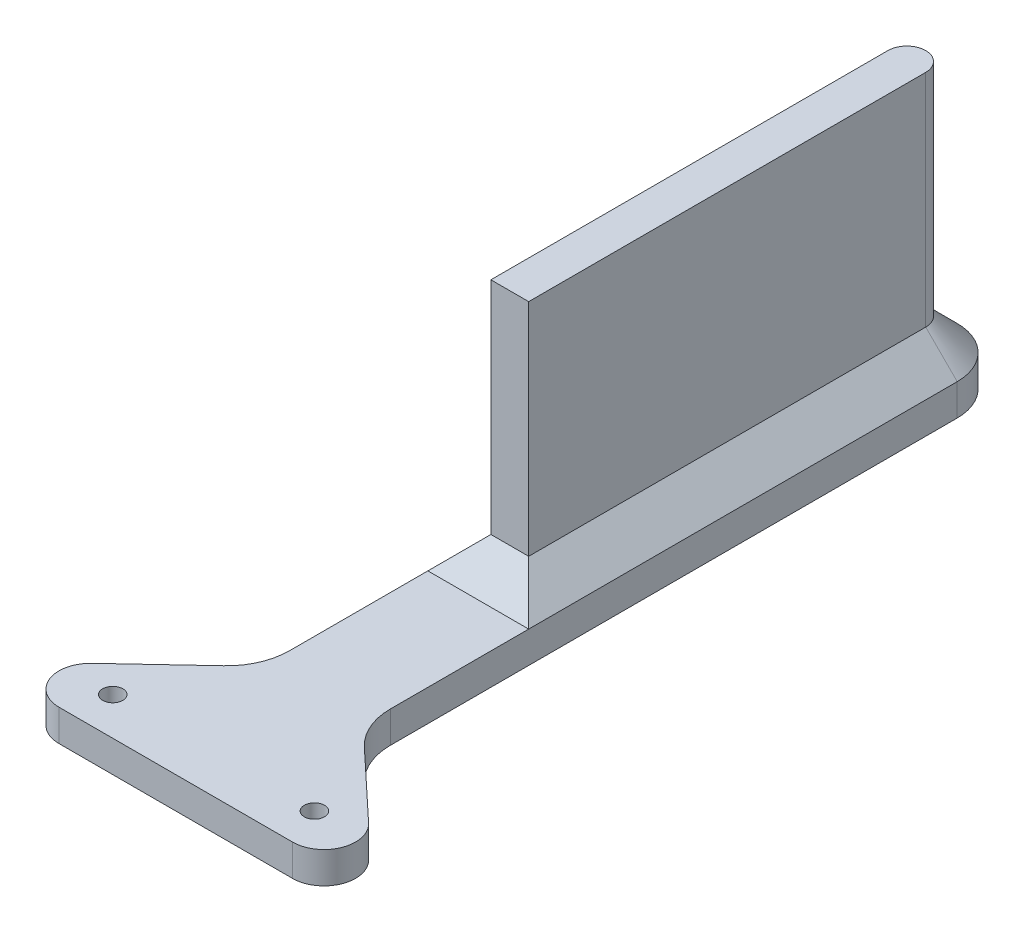
ISO-10303-21;
HEADER;
FILE_DESCRIPTION(('STEP AP214'),'2;1');
FILE_NAME('part.step','',(''),(''),'','','');
FILE_SCHEMA(('AUTOMOTIVE_DESIGN { 1 0 10303 214 1 1 1 1 }'));
ENDSEC;
DATA;
#1=APPLICATION_CONTEXT('core data for automotive mechanical design processes');
#2=APPLICATION_PROTOCOL_DEFINITION('international standard','automotive_design',2000,#1);
#3=PRODUCT_CONTEXT('',#1,'mechanical');
#4=PRODUCT('Part','Part','',(#3));
#5=PRODUCT_RELATED_PRODUCT_CATEGORY('part','',(#4));
#6=PRODUCT_DEFINITION_FORMATION('','',#4);
#7=PRODUCT_DEFINITION_CONTEXT('part definition',#1,'design');
#8=PRODUCT_DEFINITION('design','',#6,#7);
#9=PRODUCT_DEFINITION_SHAPE('','',#8);
#10=(LENGTH_UNIT() NAMED_UNIT(*) SI_UNIT(.MILLI.,.METRE.));
#11=(NAMED_UNIT(*) PLANE_ANGLE_UNIT() SI_UNIT($,.RADIAN.));
#12=(NAMED_UNIT(*) SI_UNIT($,.STERADIAN.) SOLID_ANGLE_UNIT());
#13=UNCERTAINTY_MEASURE_WITH_UNIT(LENGTH_MEASURE(1.E-05),#10,'distance_accuracy_value','');
#14=(GEOMETRIC_REPRESENTATION_CONTEXT(3) GLOBAL_UNCERTAINTY_ASSIGNED_CONTEXT((#13)) GLOBAL_UNIT_ASSIGNED_CONTEXT((#10,
#11,#12)) REPRESENTATION_CONTEXT('',''));
#15=CARTESIAN_POINT('',(0.,0.,0.));
#16=DIRECTION('',(0.,0.,1.));
#17=DIRECTION('',(1.,0.,0.));
#18=AXIS2_PLACEMENT_3D('',#15,#16,#17);
#19=CARTESIAN_POINT('',(18.,3.,-20.0567121994613));
#20=DIRECTION('',(0.,-1.,0.));
#21=DIRECTION('',(0.,0.,-1.));
#22=AXIS2_PLACEMENT_3D('',#19,#20,#21);
#23=PLANE('',#22);
#24=CARTESIAN_POINT('',(-16.,3.,0.));
#25=DIRECTION('',(0.,1.,0.));
#26=DIRECTION('',(0.,0.,1.));
#27=AXIS2_PLACEMENT_3D('',#24,#25,#26);
#28=CIRCLE('',#27,1.6);
#29=CARTESIAN_POINT('',(-16.,3.,1.6));
#30=VERTEX_POINT('',#29);
#31=EDGE_CURVE('E204',#30,#30,#28,.T.);
#32=ORIENTED_EDGE('',*,*,#31,.F.);
#33=EDGE_LOOP('',(#32));
#34=FACE_BOUND('',#33,.T.);
#35=CARTESIAN_POINT('',(16.,3.,0.));
#36=DIRECTION('',(0.,1.,0.));
#37=DIRECTION('',(0.,0.,1.));
#38=AXIS2_PLACEMENT_3D('',#35,#36,#37);
#39=CIRCLE('',#38,1.6);
#40=CARTESIAN_POINT('',(16.,3.,1.6));
#41=VERTEX_POINT('',#40);
#42=EDGE_CURVE('E203',#41,#41,#39,.T.);
#43=ORIENTED_EDGE('',*,*,#42,.F.);
#44=EDGE_LOOP('',(#43));
#45=FACE_BOUND('',#44,.T.);
#46=DIRECTION('',(0.,0.,-1.));
#47=VECTOR('',#46,1.);
#48=CARTESIAN_POINT('',(8.,3.,-95.));
#49=LINE('',#48,#47);
#50=CARTESIAN_POINT('',(8.00000000000001,3.,-20.0567121994613));
#51=VERTEX_POINT('',#50);
#52=CARTESIAN_POINT('',(8.,3.,-42.));
#53=VERTEX_POINT('',#52);
#54=EDGE_CURVE('E229',#51,#53,#49,.T.);
#55=ORIENTED_EDGE('',*,*,#54,.T.);
#56=DIRECTION('',(-1.,0.,0.));
#57=VECTOR('',#56,1.);
#58=CARTESIAN_POINT('',(-3.,3.,-42.));
#59=LINE('',#58,#57);
#60=CARTESIAN_POINT('',(-8.,3.,-42.));
#61=VERTEX_POINT('',#60);
#62=EDGE_CURVE('E270',#53,#61,#59,.T.);
#63=ORIENTED_EDGE('',*,*,#62,.T.);
#64=DIRECTION('',(0.,0.,1.));
#65=VECTOR('',#64,1.);
#66=CARTESIAN_POINT('',(-8.,3.,-110.));
#67=LINE('',#66,#65);
#68=CARTESIAN_POINT('',(-8.,3.,-20.0567121994614));
#69=VERTEX_POINT('',#68);
#70=EDGE_CURVE('E235',#61,#69,#67,.T.);
#71=ORIENTED_EDGE('',*,*,#70,.T.);
#72=CARTESIAN_POINT('',(-18.,3.,-20.0567121994613));
#73=DIRECTION('',(0.,-1.,0.));
#74=DIRECTION('',(0.,0.,1.));
#75=AXIS2_PLACEMENT_3D('',#72,#73,#74);
#76=CIRCLE('',#75,10.);
#77=CARTESIAN_POINT('',(-11.1605887111867,3.,-12.7613401580604));
#78=VERTEX_POINT('',#77);
#79=EDGE_CURVE('E239',#69,#78,#76,.T.);
#80=ORIENTED_EDGE('',*,*,#79,.T.);
#81=DIRECTION('',(-0.729537204140085,0.,0.68394112888133));
#82=VECTOR('',#81,1.);
#83=CARTESIAN_POINT('',(-11.1605887111867,3.,-12.7613401580604));
#84=LINE('',#83,#82);
#85=CARTESIAN_POINT('',(-21.948486457704,3.,-2.64768602070051));
#86=VERTEX_POINT('',#85);
#87=EDGE_CURVE('E241',#78,#86,#84,.T.);
#88=ORIENTED_EDGE('',*,*,#87,.T.);
#89=CARTESIAN_POINT('',(-18.5287808132974,3.,1.));
#90=DIRECTION('',(0.,1.,0.));
#91=DIRECTION('',(0.,0.,-1.));
#92=AXIS2_PLACEMENT_3D('',#89,#90,#91);
#93=CIRCLE('',#92,5.);
#94=CARTESIAN_POINT('',(-18.5287808132973,3.,6.));
#95=VERTEX_POINT('',#94);
#96=EDGE_CURVE('E243',#86,#95,#93,.T.);
#97=ORIENTED_EDGE('',*,*,#96,.T.);
#98=DIRECTION('',(1.,0.,0.));
#99=VECTOR('',#98,1.);
#100=CARTESIAN_POINT('',(-18.5287808132973,3.,6.));
#101=LINE('',#100,#99);
#102=CARTESIAN_POINT('',(18.5287808132973,3.,6.));
#103=VERTEX_POINT('',#102);
#104=EDGE_CURVE('E245',#95,#103,#101,.T.);
#105=ORIENTED_EDGE('',*,*,#104,.T.);
#106=CARTESIAN_POINT('',(18.5287808132974,3.,0.999999999999999));
#107=DIRECTION('',(0.,1.,0.));
#108=DIRECTION('',(0.,0.,1.));
#109=AXIS2_PLACEMENT_3D('',#106,#107,#108);
#110=CIRCLE('',#109,5.);
#111=CARTESIAN_POINT('',(21.948486457704,3.,-2.64768602070052));
#112=VERTEX_POINT('',#111);
#113=EDGE_CURVE('E247',#103,#112,#110,.T.);
#114=ORIENTED_EDGE('',*,*,#113,.T.);
#115=DIRECTION('',(-0.729537204140085,0.,-0.683941128881329));
#116=VECTOR('',#115,1.);
#117=CARTESIAN_POINT('',(21.948486457704,3.,-2.64768602070052));
#118=LINE('',#117,#116);
#119=CARTESIAN_POINT('',(11.1605887111867,3.,-12.7613401580604));
#120=VERTEX_POINT('',#119);
#121=EDGE_CURVE('E160',#112,#120,#118,.T.);
#122=ORIENTED_EDGE('',*,*,#121,.T.);
#123=CARTESIAN_POINT('',(18.,3.,-20.0567121994613));
#124=DIRECTION('',(0.,-1.,0.));
#125=DIRECTION('',(0.,0.,-1.));
#126=AXIS2_PLACEMENT_3D('',#123,#124,#125);
#127=CIRCLE('',#126,10.);
#128=EDGE_CURVE('E156',#120,#51,#127,.T.);
#129=ORIENTED_EDGE('',*,*,#128,.T.);
#130=EDGE_LOOP('',(#55,#63,#71,#80,#88,#97,#105,#114,#122,#129));
#131=FACE_BOUND('',#130,.T.);
#132=ADVANCED_FACE('F37',(#34,#45,#131),#23,.F.);
#133=CARTESIAN_POINT('',(18.,3.,-20.0567121994613));
#134=DIRECTION('',(0.,-1.,0.));
#135=DIRECTION('',(0.,0.,-1.));
#136=AXIS2_PLACEMENT_3D('',#133,#134,#135);
#137=CYLINDRICAL_SURFACE('',#136,10.);
#138=DIRECTION('',(0.,-1.,0.));
#139=VECTOR('',#138,1.);
#140=CARTESIAN_POINT('',(11.1605887111867,3.,-12.7613401580604));
#141=LINE('',#140,#139);
#142=CARTESIAN_POINT('',(11.1605887111867,-2.,-12.7613401580604));
#143=VERTEX_POINT('',#142);
#144=EDGE_CURVE('E149',#120,#143,#141,.T.);
#145=ORIENTED_EDGE('',*,*,#144,.T.);
#146=CARTESIAN_POINT('',(18.,-2.,-20.0567121994613));
#147=DIRECTION('',(0.,1.,0.));
#148=DIRECTION('',(0.,0.,-1.));
#149=AXIS2_PLACEMENT_3D('',#146,#147,#148);
#150=CIRCLE('',#149,10.);
#151=CARTESIAN_POINT('',(8.,-2.,-20.0567121994613));
#152=VERTEX_POINT('',#151);
#153=EDGE_CURVE('E154',#152,#143,#150,.T.);
#154=ORIENTED_EDGE('',*,*,#153,.F.);
#155=DIRECTION('',(0.,-1.,0.));
#156=VECTOR('',#155,1.);
#157=CARTESIAN_POINT('',(8.00000000000001,3.,-20.0567121994613));
#158=LINE('',#157,#156);
#159=EDGE_CURVE('E265',#51,#152,#158,.T.);
#160=ORIENTED_EDGE('',*,*,#159,.F.);
#161=ORIENTED_EDGE('',*,*,#128,.F.);
#162=EDGE_LOOP('',(#145,#154,#160,#161));
#163=FACE_BOUND('',#162,.T.);
#164=ADVANCED_FACE('F151',(#163),#137,.F.);
#165=CARTESIAN_POINT('',(8.,3.,-95.));
#166=DIRECTION('',(-1.,0.,0.));
#167=DIRECTION('',(0.,0.,1.));
#168=AXIS2_PLACEMENT_3D('',#165,#166,#167);
#169=PLANE('',#168);
#170=ORIENTED_EDGE('',*,*,#159,.T.);
#171=DIRECTION('',(0.,0.,1.));
#172=VECTOR('',#171,1.);
#173=CARTESIAN_POINT('',(8.,-2.,-110.));
#174=LINE('',#173,#172);
#175=CARTESIAN_POINT('',(8.,-2.,-110.));
#176=VERTEX_POINT('',#175);
#177=EDGE_CURVE('E176',#176,#152,#174,.T.);
#178=ORIENTED_EDGE('',*,*,#177,.F.);
#179=DIRECTION('',(0.,-1.,0.));
#180=VECTOR('',#179,1.);
#181=CARTESIAN_POINT('',(8.,3.,-110.));
#182=LINE('',#181,#180);
#183=CARTESIAN_POINT('',(8.,3.,-110.));
#184=VERTEX_POINT('',#183);
#185=EDGE_CURVE('E263',#184,#176,#182,.T.);
#186=ORIENTED_EDGE('',*,*,#185,.F.);
#187=EDGE_CURVE('E228',#53,#184,#49,.T.);
#188=ORIENTED_EDGE('',*,*,#187,.F.);
#189=ORIENTED_EDGE('',*,*,#54,.F.);
#190=EDGE_LOOP('',(#170,#178,#186,#188,#189));
#191=FACE_BOUND('',#190,.T.);
#192=ADVANCED_FACE('F336',(#191),#169,.F.);
#193=CARTESIAN_POINT('',(0.,3.,-110.));
#194=DIRECTION('',(0.,-1.,0.));
#195=DIRECTION('',(0.,0.,-1.));
#196=AXIS2_PLACEMENT_3D('',#193,#194,#195);
#197=CYLINDRICAL_SURFACE('',#196,8.);
#198=ORIENTED_EDGE('',*,*,#185,.T.);
#199=CARTESIAN_POINT('',(0.,-2.,-110.));
#200=DIRECTION('',(0.,-1.,0.));
#201=DIRECTION('',(0.,0.,-1.));
#202=AXIS2_PLACEMENT_3D('',#199,#200,#201);
#203=CIRCLE('',#202,8.);
#204=CARTESIAN_POINT('',(-8.,-2.,-110.));
#205=VERTEX_POINT('',#204);
#206=EDGE_CURVE('E200',#205,#176,#203,.T.);
#207=ORIENTED_EDGE('',*,*,#206,.F.);
#208=DIRECTION('',(0.,-1.,0.));
#209=VECTOR('',#208,1.);
#210=CARTESIAN_POINT('',(-8.,3.,-110.));
#211=LINE('',#210,#209);
#212=CARTESIAN_POINT('',(-8.,3.,-110.));
#213=VERTEX_POINT('',#212);
#214=EDGE_CURVE('E261',#213,#205,#211,.T.);
#215=ORIENTED_EDGE('',*,*,#214,.F.);
#216=CARTESIAN_POINT('',(0.,3.,-110.));
#217=DIRECTION('',(0.,1.,0.));
#218=DIRECTION('',(0.,0.,1.));
#219=AXIS2_PLACEMENT_3D('',#216,#217,#218);
#220=CIRCLE('',#219,8.);
#221=EDGE_CURVE('E232',#184,#213,#220,.T.);
#222=ORIENTED_EDGE('',*,*,#221,.F.);
#223=EDGE_LOOP('',(#198,#207,#215,#222));
#224=FACE_BOUND('',#223,.T.);
#225=ADVANCED_FACE('F292',(#224),#197,.T.);
#226=CARTESIAN_POINT('',(-8.,3.,-95.));
#227=DIRECTION('',(1.,0.,0.));
#228=DIRECTION('',(0.,0.,-1.));
#229=AXIS2_PLACEMENT_3D('',#226,#227,#228);
#230=PLANE('',#229);
#231=ORIENTED_EDGE('',*,*,#214,.T.);
#232=DIRECTION('',(0.,0.,-1.));
#233=VECTOR('',#232,1.);
#234=CARTESIAN_POINT('',(-8.,-2.,-20.0567121994614));
#235=LINE('',#234,#233);
#236=CARTESIAN_POINT('',(-8.,-2.,-20.0567121994614));
#237=VERTEX_POINT('',#236);
#238=EDGE_CURVE('E197',#237,#205,#235,.T.);
#239=ORIENTED_EDGE('',*,*,#238,.F.);
#240=DIRECTION('',(0.,-1.,0.));
#241=VECTOR('',#240,1.);
#242=CARTESIAN_POINT('',(-8.,3.,-20.0567121994614));
#243=LINE('',#242,#241);
#244=EDGE_CURVE('E259',#69,#237,#243,.T.);
#245=ORIENTED_EDGE('',*,*,#244,.F.);
#246=ORIENTED_EDGE('',*,*,#70,.F.);
#247=EDGE_CURVE('E236',#213,#61,#67,.T.);
#248=ORIENTED_EDGE('',*,*,#247,.F.);
#249=EDGE_LOOP('',(#231,#239,#245,#246,#248));
#250=FACE_BOUND('',#249,.T.);
#251=ADVANCED_FACE('F297',(#250),#230,.F.);
#252=CARTESIAN_POINT('',(-18.,3.,-20.0567121994613));
#253=DIRECTION('',(0.,-1.,0.));
#254=DIRECTION('',(0.,0.,-1.));
#255=AXIS2_PLACEMENT_3D('',#252,#253,#254);
#256=CYLINDRICAL_SURFACE('',#255,10.);
#257=ORIENTED_EDGE('',*,*,#244,.T.);
#258=CARTESIAN_POINT('',(-18.,-2.,-20.0567121994613));
#259=DIRECTION('',(0.,1.,0.));
#260=DIRECTION('',(0.,0.,-1.));
#261=AXIS2_PLACEMENT_3D('',#258,#259,#260);
#262=CIRCLE('',#261,10.);
#263=CARTESIAN_POINT('',(-11.1605887111867,-2.,-12.7613401580604));
#264=VERTEX_POINT('',#263);
#265=EDGE_CURVE('E194',#264,#237,#262,.T.);
#266=ORIENTED_EDGE('',*,*,#265,.F.);
#267=DIRECTION('',(0.,-1.,0.));
#268=VECTOR('',#267,1.);
#269=CARTESIAN_POINT('',(-11.1605887111867,3.,-12.7613401580604));
#270=LINE('',#269,#268);
#271=EDGE_CURVE('E257',#78,#264,#270,.T.);
#272=ORIENTED_EDGE('',*,*,#271,.F.);
#273=ORIENTED_EDGE('',*,*,#79,.F.);
#274=EDGE_LOOP('',(#257,#266,#272,#273));
#275=FACE_BOUND('',#274,.T.);
#276=ADVANCED_FACE('F358',(#275),#256,.F.);
#277=CARTESIAN_POINT('',(-11.1605887111867,3.,-12.7613401580604));
#278=DIRECTION('',(0.68394112888133,0.,0.729537204140085));
#279=DIRECTION('',(0.729537204140085,0.,-0.68394112888133));
#280=AXIS2_PLACEMENT_3D('',#277,#278,#279);
#281=PLANE('',#280);
#282=ORIENTED_EDGE('',*,*,#271,.T.);
#283=DIRECTION('',(0.729537204140085,0.,-0.68394112888133));
#284=VECTOR('',#283,1.);
#285=CARTESIAN_POINT('',(-21.948486457704,-2.,-2.64768602070051));
#286=LINE('',#285,#284);
#287=CARTESIAN_POINT('',(-21.948486457704,-2.,-2.64768602070051));
#288=VERTEX_POINT('',#287);
#289=EDGE_CURVE('E191',#288,#264,#286,.T.);
#290=ORIENTED_EDGE('',*,*,#289,.F.);
#291=DIRECTION('',(0.,-1.,0.));
#292=VECTOR('',#291,1.);
#293=CARTESIAN_POINT('',(-21.948486457704,3.,-2.64768602070051));
#294=LINE('',#293,#292);
#295=EDGE_CURVE('E255',#86,#288,#294,.T.);
#296=ORIENTED_EDGE('',*,*,#295,.F.);
#297=ORIENTED_EDGE('',*,*,#87,.F.);
#298=EDGE_LOOP('',(#282,#290,#296,#297));
#299=FACE_BOUND('',#298,.T.);
#300=ADVANCED_FACE('F354',(#299),#281,.F.);
#301=CARTESIAN_POINT('',(-18.5287808132974,3.,1.));
#302=DIRECTION('',(0.,-1.,0.));
#303=DIRECTION('',(0.,0.,-1.));
#304=AXIS2_PLACEMENT_3D('',#301,#302,#303);
#305=CYLINDRICAL_SURFACE('',#304,5.);
#306=ORIENTED_EDGE('',*,*,#295,.T.);
#307=CARTESIAN_POINT('',(-18.5287808132974,-2.,1.));
#308=DIRECTION('',(0.,-1.,0.));
#309=DIRECTION('',(0.,0.,-1.));
#310=AXIS2_PLACEMENT_3D('',#307,#308,#309);
#311=CIRCLE('',#310,5.);
#312=CARTESIAN_POINT('',(-18.5287808132973,-2.,6.));
#313=VERTEX_POINT('',#312);
#314=EDGE_CURVE('E188',#313,#288,#311,.T.);
#315=ORIENTED_EDGE('',*,*,#314,.F.);
#316=DIRECTION('',(0.,-1.,0.));
#317=VECTOR('',#316,1.);
#318=CARTESIAN_POINT('',(-18.5287808132973,3.,6.));
#319=LINE('',#318,#317);
#320=EDGE_CURVE('E253',#95,#313,#319,.T.);
#321=ORIENTED_EDGE('',*,*,#320,.F.);
#322=ORIENTED_EDGE('',*,*,#96,.F.);
#323=EDGE_LOOP('',(#306,#315,#321,#322));
#324=FACE_BOUND('',#323,.T.);
#325=ADVANCED_FACE('F350',(#324),#305,.T.);
#326=CARTESIAN_POINT('',(-18.5287808132973,3.,6.));
#327=DIRECTION('',(0.,0.,-1.));
#328=DIRECTION('',(-1.,0.,0.));
#329=AXIS2_PLACEMENT_3D('',#326,#327,#328);
#330=PLANE('',#329);
#331=ORIENTED_EDGE('',*,*,#320,.T.);
#332=DIRECTION('',(-1.,0.,0.));
#333=VECTOR('',#332,1.);
#334=CARTESIAN_POINT('',(18.5287808132973,-2.,6.));
#335=LINE('',#334,#333);
#336=CARTESIAN_POINT('',(18.5287808132973,-2.,6.));
#337=VERTEX_POINT('',#336);
#338=EDGE_CURVE('E185',#337,#313,#335,.T.);
#339=ORIENTED_EDGE('',*,*,#338,.F.);
#340=DIRECTION('',(0.,-1.,0.));
#341=VECTOR('',#340,1.);
#342=CARTESIAN_POINT('',(18.5287808132973,3.,6.));
#343=LINE('',#342,#341);
#344=EDGE_CURVE('E251',#103,#337,#343,.T.);
#345=ORIENTED_EDGE('',*,*,#344,.F.);
#346=ORIENTED_EDGE('',*,*,#104,.F.);
#347=EDGE_LOOP('',(#331,#339,#345,#346));
#348=FACE_BOUND('',#347,.T.);
#349=ADVANCED_FACE('F346',(#348),#330,.F.);
#350=CARTESIAN_POINT('',(18.5287808132974,3.,0.999999999999999));
#351=DIRECTION('',(0.,-1.,0.));
#352=DIRECTION('',(0.,0.,-1.));
#353=AXIS2_PLACEMENT_3D('',#350,#351,#352);
#354=CYLINDRICAL_SURFACE('',#353,5.);
#355=ORIENTED_EDGE('',*,*,#344,.T.);
#356=CARTESIAN_POINT('',(18.5287808132974,-2.,0.999999999999999));
#357=DIRECTION('',(0.,-1.,0.));
#358=DIRECTION('',(0.,0.,-1.));
#359=AXIS2_PLACEMENT_3D('',#356,#357,#358);
#360=CIRCLE('',#359,5.);
#361=CARTESIAN_POINT('',(21.948486457704,-2.,-2.64768602070052));
#362=VERTEX_POINT('',#361);
#363=EDGE_CURVE('E169',#362,#337,#360,.T.);
#364=ORIENTED_EDGE('',*,*,#363,.F.);
#365=DIRECTION('',(0.,-1.,0.));
#366=VECTOR('',#365,1.);
#367=CARTESIAN_POINT('',(21.948486457704,3.,-2.64768602070052));
#368=LINE('',#367,#366);
#369=EDGE_CURVE('E159',#112,#362,#368,.T.);
#370=ORIENTED_EDGE('',*,*,#369,.F.);
#371=ORIENTED_EDGE('',*,*,#113,.F.);
#372=EDGE_LOOP('',(#355,#364,#370,#371));
#373=FACE_BOUND('',#372,.T.);
#374=ADVANCED_FACE('F343',(#373),#354,.T.);
#375=CARTESIAN_POINT('',(21.948486457704,3.,-2.64768602070052));
#376=DIRECTION('',(-0.683941128881329,0.,0.729537204140085));
#377=DIRECTION('',(0.729537204140085,0.,0.683941128881329));
#378=AXIS2_PLACEMENT_3D('',#375,#376,#377);
#379=PLANE('',#378);
#380=ORIENTED_EDGE('',*,*,#369,.T.);
#381=DIRECTION('',(0.729537204140085,0.,0.68394112888133));
#382=VECTOR('',#381,1.);
#383=CARTESIAN_POINT('',(11.1605887111867,-2.,-12.7613401580604));
#384=LINE('',#383,#382);
#385=EDGE_CURVE('E163',#143,#362,#384,.T.);
#386=ORIENTED_EDGE('',*,*,#385,.F.);
#387=ORIENTED_EDGE('',*,*,#144,.F.);
#388=ORIENTED_EDGE('',*,*,#121,.F.);
#389=EDGE_LOOP('',(#380,#386,#387,#388));
#390=FACE_BOUND('',#389,.T.);
#391=ADVANCED_FACE('F164',(#390),#379,.F.);
#392=CARTESIAN_POINT('',(3.,43.,-110.));
#393=DIRECTION('',(-1.,0.,0.));
#394=DIRECTION('',(0.,0.,1.));
#395=AXIS2_PLACEMENT_3D('',#392,#393,#394);
#396=PLANE('',#395);
#397=DIRECTION('',(0.,-1.,0.));
#398=VECTOR('',#397,1.);
#399=CARTESIAN_POINT('',(3.,43.,-47.));
#400=LINE('',#399,#398);
#401=CARTESIAN_POINT('',(3.,43.,-47.));
#402=VERTEX_POINT('',#401);
#403=CARTESIAN_POINT('',(3.,8.00000000000004,-47.));
#404=VERTEX_POINT('',#403);
#405=EDGE_CURVE('E218',#402,#404,#400,.T.);
#406=ORIENTED_EDGE('',*,*,#405,.T.);
#407=DIRECTION('',(0.,0.,-1.));
#408=VECTOR('',#407,1.);
#409=CARTESIAN_POINT('',(3.,8.00000000000004,-110.));
#410=LINE('',#409,#408);
#411=CARTESIAN_POINT('',(3.,8.00000000000004,-110.));
#412=VERTEX_POINT('',#411);
#413=EDGE_CURVE('E62',#404,#412,#410,.T.);
#414=ORIENTED_EDGE('',*,*,#413,.T.);
#415=DIRECTION('',(0.,-1.,0.));
#416=VECTOR('',#415,1.);
#417=CARTESIAN_POINT('',(3.,43.,-110.));
#418=LINE('',#417,#416);
#419=CARTESIAN_POINT('',(3.,43.,-110.));
#420=VERTEX_POINT('',#419);
#421=EDGE_CURVE('E225',#420,#412,#418,.T.);
#422=ORIENTED_EDGE('',*,*,#421,.F.);
#423=DIRECTION('',(0.,0.,-1.));
#424=VECTOR('',#423,1.);
#425=CARTESIAN_POINT('',(3.,43.,-47.));
#426=LINE('',#425,#424);
#427=EDGE_CURVE('E210',#402,#420,#426,.T.);
#428=ORIENTED_EDGE('',*,*,#427,.F.);
#429=EDGE_LOOP('',(#406,#414,#422,#428));
#430=FACE_BOUND('',#429,.T.);
#431=ADVANCED_FACE('F314',(#430),#396,.F.);
#432=CARTESIAN_POINT('',(0.,43.,-110.));
#433=DIRECTION('',(0.,-1.,0.));
#434=DIRECTION('',(0.,0.,-1.));
#435=AXIS2_PLACEMENT_3D('',#432,#433,#434);
#436=CYLINDRICAL_SURFACE('',#435,3.);
#437=ORIENTED_EDGE('',*,*,#421,.T.);
#438=CARTESIAN_POINT('',(0.,8.00000000000004,-110.));
#439=DIRECTION('',(0.,-1.,0.));
#440=DIRECTION('',(0.,0.,-1.));
#441=AXIS2_PLACEMENT_3D('',#438,#439,#440);
#442=CIRCLE('',#441,3.);
#443=CARTESIAN_POINT('',(-3.,8.00000000000004,-110.));
#444=VERTEX_POINT('',#443);
#445=EDGE_CURVE('E47',#412,#444,#442,.F.);
#446=ORIENTED_EDGE('',*,*,#445,.T.);
#447=DIRECTION('',(0.,-1.,0.));
#448=VECTOR('',#447,1.);
#449=CARTESIAN_POINT('',(-3.,43.,-110.));
#450=LINE('',#449,#448);
#451=CARTESIAN_POINT('',(-3.,43.,-110.));
#452=VERTEX_POINT('',#451);
#453=EDGE_CURVE('E223',#452,#444,#450,.T.);
#454=ORIENTED_EDGE('',*,*,#453,.F.);
#455=CARTESIAN_POINT('',(0.,43.,-110.));
#456=DIRECTION('',(0.,1.,0.));
#457=DIRECTION('',(0.,0.,1.));
#458=AXIS2_PLACEMENT_3D('',#455,#456,#457);
#459=CIRCLE('',#458,3.);
#460=EDGE_CURVE('E212',#420,#452,#459,.T.);
#461=ORIENTED_EDGE('',*,*,#460,.F.);
#462=EDGE_LOOP('',(#437,#446,#454,#461));
#463=FACE_BOUND('',#462,.T.);
#464=ADVANCED_FACE('F321',(#463),#436,.T.);
#465=CARTESIAN_POINT('',(-3.,43.,-95.));
#466=DIRECTION('',(1.,0.,0.));
#467=DIRECTION('',(0.,0.,-1.));
#468=AXIS2_PLACEMENT_3D('',#465,#466,#467);
#469=PLANE('',#468);
#470=ORIENTED_EDGE('',*,*,#453,.T.);
#471=DIRECTION('',(0.,0.,1.));
#472=VECTOR('',#471,1.);
#473=CARTESIAN_POINT('',(-3.,8.00000000000004,-47.));
#474=LINE('',#473,#472);
#475=CARTESIAN_POINT('',(-3.,8.00000000000004,-47.));
#476=VERTEX_POINT('',#475);
#477=EDGE_CURVE('E11',#444,#476,#474,.T.);
#478=ORIENTED_EDGE('',*,*,#477,.T.);
#479=DIRECTION('',(0.,-1.,0.));
#480=VECTOR('',#479,1.);
#481=CARTESIAN_POINT('',(-3.,43.,-47.));
#482=LINE('',#481,#480);
#483=CARTESIAN_POINT('',(-3.,43.,-47.));
#484=VERTEX_POINT('',#483);
#485=EDGE_CURVE('E220',#484,#476,#482,.T.);
#486=ORIENTED_EDGE('',*,*,#485,.F.);
#487=DIRECTION('',(0.,0.,1.));
#488=VECTOR('',#487,1.);
#489=CARTESIAN_POINT('',(-3.,43.,-95.));
#490=LINE('',#489,#488);
#491=EDGE_CURVE('E214',#452,#484,#490,.T.);
#492=ORIENTED_EDGE('',*,*,#491,.F.);
#493=EDGE_LOOP('',(#470,#478,#486,#492));
#494=FACE_BOUND('',#493,.T.);
#495=ADVANCED_FACE('F320',(#494),#469,.F.);
#496=CARTESIAN_POINT('',(3.,43.,-47.));
#497=DIRECTION('',(0.,0.,-1.));
#498=DIRECTION('',(-1.,0.,0.));
#499=AXIS2_PLACEMENT_3D('',#496,#497,#498);
#500=PLANE('',#499);
#501=ORIENTED_EDGE('',*,*,#485,.T.);
#502=DIRECTION('',(1.,0.,0.));
#503=VECTOR('',#502,1.);
#504=CARTESIAN_POINT('',(3.,8.00000000000004,-47.));
#505=LINE('',#504,#503);
#506=EDGE_CURVE('E267',#476,#404,#505,.T.);
#507=ORIENTED_EDGE('',*,*,#506,.T.);
#508=ORIENTED_EDGE('',*,*,#405,.F.);
#509=DIRECTION('',(1.,0.,0.));
#510=VECTOR('',#509,1.);
#511=CARTESIAN_POINT('',(3.,43.,-47.));
#512=LINE('',#511,#510);
#513=EDGE_CURVE('E216',#484,#402,#512,.T.);
#514=ORIENTED_EDGE('',*,*,#513,.F.);
#515=EDGE_LOOP('',(#501,#507,#508,#514));
#516=FACE_BOUND('',#515,.T.);
#517=ADVANCED_FACE('F310',(#516),#500,.F.);
#518=CARTESIAN_POINT('',(0.,43.,-110.));
#519=DIRECTION('',(0.,1.,0.));
#520=DIRECTION('',(0.,0.,1.));
#521=AXIS2_PLACEMENT_3D('',#518,#519,#520);
#522=PLANE('',#521);
#523=ORIENTED_EDGE('',*,*,#427,.T.);
#524=ORIENTED_EDGE('',*,*,#460,.T.);
#525=ORIENTED_EDGE('',*,*,#491,.T.);
#526=ORIENTED_EDGE('',*,*,#513,.T.);
#527=EDGE_LOOP('',(#523,#524,#525,#526));
#528=FACE_BOUND('',#527,.T.);
#529=ADVANCED_FACE('F317',(#528),#522,.T.);
#530=CARTESIAN_POINT('',(0.,8.00000000000004,-110.));
#531=DIRECTION('',(0.,-1.,0.));
#532=DIRECTION('',(0.,0.,-1.));
#533=AXIS2_PLACEMENT_3D('',#530,#531,#532);
#534=CONICAL_SURFACE('',#533,3.,0.785398163397443);
#535=DIRECTION('',(-0.707106781186544,0.707106781186551,0.));
#536=VECTOR('',#535,1.);
#537=CARTESIAN_POINT('',(7.99999999999999,3.,-110.));
#538=LINE('',#537,#536);
#539=EDGE_CURVE('E277',#184,#412,#538,.T.);
#540=ORIENTED_EDGE('',*,*,#539,.F.);
#541=ORIENTED_EDGE('',*,*,#221,.T.);
#542=DIRECTION('',(-0.707106781186544,-0.707106781186551,0.));
#543=VECTOR('',#542,1.);
#544=CARTESIAN_POINT('',(-3.,8.00000000000004,-110.));
#545=LINE('',#544,#543);
#546=EDGE_CURVE('E42',#444,#213,#545,.T.);
#547=ORIENTED_EDGE('',*,*,#546,.F.);
#548=ORIENTED_EDGE('',*,*,#445,.F.);
#549=EDGE_LOOP('',(#540,#541,#547,#548));
#550=FACE_BOUND('',#549,.T.);
#551=ADVANCED_FACE('F40',(#550),#534,.T.);
#552=CARTESIAN_POINT('',(-3.,8.00000000000004,-95.));
#553=DIRECTION('',(-0.707106781186551,0.707106781186544,0.));
#554=DIRECTION('',(0.,0.,-1.));
#555=AXIS2_PLACEMENT_3D('',#552,#553,#554);
#556=PLANE('',#555);
#557=ORIENTED_EDGE('',*,*,#546,.T.);
#558=ORIENTED_EDGE('',*,*,#247,.T.);
#559=DIRECTION('',(0.577350269189624,0.57735026918963,-0.577350269189624));
#560=VECTOR('',#559,1.);
#561=CARTESIAN_POINT('',(12.9999999999999,24.0000000000001,-62.9999999999999));
#562=LINE('',#561,#560);
#563=EDGE_CURVE('E276',#476,#61,#562,.F.);
#564=ORIENTED_EDGE('',*,*,#563,.F.);
#565=ORIENTED_EDGE('',*,*,#477,.F.);
#566=EDGE_LOOP('',(#557,#558,#564,#565));
#567=FACE_BOUND('',#566,.T.);
#568=ADVANCED_FACE('F286',(#567),#556,.T.);
#569=CARTESIAN_POINT('',(3.,8.00000000000004,-110.));
#570=DIRECTION('',(0.707106781186551,0.707106781186544,0.));
#571=DIRECTION('',(0.,0.,1.));
#572=AXIS2_PLACEMENT_3D('',#569,#570,#571);
#573=PLANE('',#572);
#574=ORIENTED_EDGE('',*,*,#539,.T.);
#575=ORIENTED_EDGE('',*,*,#413,.F.);
#576=DIRECTION('',(0.577350269189624,-0.57735026918963,0.577350269189624));
#577=VECTOR('',#576,1.);
#578=CARTESIAN_POINT('',(-17.9999999999999,29.0000000000001,-67.9999999999999));
#579=LINE('',#578,#577);
#580=EDGE_CURVE('E207',#53,#404,#579,.F.);
#581=ORIENTED_EDGE('',*,*,#580,.F.);
#582=ORIENTED_EDGE('',*,*,#187,.T.);
#583=EDGE_LOOP('',(#574,#575,#581,#582));
#584=FACE_BOUND('',#583,.T.);
#585=ADVANCED_FACE('F307',(#584),#573,.T.);
#586=CARTESIAN_POINT('',(3.,8.00000000000004,-47.));
#587=DIRECTION('',(0.,0.707106781186544,0.707106781186551));
#588=DIRECTION('',(-1.,0.,0.));
#589=AXIS2_PLACEMENT_3D('',#586,#587,#588);
#590=PLANE('',#589);
#591=ORIENTED_EDGE('',*,*,#563,.T.);
#592=ORIENTED_EDGE('',*,*,#62,.F.);
#593=ORIENTED_EDGE('',*,*,#580,.T.);
#594=ORIENTED_EDGE('',*,*,#506,.F.);
#595=EDGE_LOOP('',(#591,#592,#593,#594));
#596=FACE_BOUND('',#595,.T.);
#597=ADVANCED_FACE('F305',(#596),#590,.T.);
#598=CARTESIAN_POINT('',(16.,-7.,0.));
#599=DIRECTION('',(0.,1.,0.));
#600=DIRECTION('',(0.,0.,1.));
#601=AXIS2_PLACEMENT_3D('',#598,#599,#600);
#602=CYLINDRICAL_SURFACE('',#601,1.6);
#603=ORIENTED_EDGE('',*,*,#42,.T.);
#604=EDGE_LOOP('',(#603));
#605=FACE_BOUND('',#604,.T.);
#606=CARTESIAN_POINT('',(16.,-2.,0.));
#607=DIRECTION('',(0.,-1.,0.));
#608=DIRECTION('',(0.,0.,-1.));
#609=AXIS2_PLACEMENT_3D('',#606,#607,#608);
#610=CIRCLE('',#609,1.6);
#611=CARTESIAN_POINT('',(16.,-2.,-1.60000000000001));
#612=VERTEX_POINT('',#611);
#613=EDGE_CURVE('E180',#612,#612,#610,.T.);
#614=ORIENTED_EDGE('',*,*,#613,.T.);
#615=EDGE_LOOP('',(#614));
#616=FACE_BOUND('',#615,.T.);
#617=ADVANCED_FACE('F376',(#605,#616),#602,.F.);
#618=CARTESIAN_POINT('',(-16.,-7.,0.));
#619=DIRECTION('',(0.,1.,0.));
#620=DIRECTION('',(0.,0.,1.));
#621=AXIS2_PLACEMENT_3D('',#618,#619,#620);
#622=CYLINDRICAL_SURFACE('',#621,1.6);
#623=ORIENTED_EDGE('',*,*,#31,.T.);
#624=EDGE_LOOP('',(#623));
#625=FACE_BOUND('',#624,.T.);
#626=CARTESIAN_POINT('',(-16.,-2.,0.));
#627=DIRECTION('',(0.,-1.,0.));
#628=DIRECTION('',(0.,0.,-1.));
#629=AXIS2_PLACEMENT_3D('',#626,#627,#628);
#630=CIRCLE('',#629,1.6);
#631=CARTESIAN_POINT('',(-16.,-2.,-1.6));
#632=VERTEX_POINT('',#631);
#633=EDGE_CURVE('E177',#632,#632,#630,.T.);
#634=ORIENTED_EDGE('',*,*,#633,.T.);
#635=EDGE_LOOP('',(#634));
#636=FACE_BOUND('',#635,.T.);
#637=ADVANCED_FACE('F398',(#625,#636),#622,.F.);
#638=CARTESIAN_POINT('',(18.,-2.,-20.0567121994613));
#639=DIRECTION('',(0.,-1.,0.));
#640=DIRECTION('',(0.,0.,-1.));
#641=AXIS2_PLACEMENT_3D('',#638,#639,#640);
#642=PLANE('',#641);
#643=ORIENTED_EDGE('',*,*,#633,.F.);
#644=EDGE_LOOP('',(#643));
#645=FACE_BOUND('',#644,.T.);
#646=ORIENTED_EDGE('',*,*,#153,.T.);
#647=ORIENTED_EDGE('',*,*,#385,.T.);
#648=ORIENTED_EDGE('',*,*,#363,.T.);
#649=ORIENTED_EDGE('',*,*,#338,.T.);
#650=ORIENTED_EDGE('',*,*,#314,.T.);
#651=ORIENTED_EDGE('',*,*,#289,.T.);
#652=ORIENTED_EDGE('',*,*,#265,.T.);
#653=ORIENTED_EDGE('',*,*,#238,.T.);
#654=ORIENTED_EDGE('',*,*,#206,.T.);
#655=ORIENTED_EDGE('',*,*,#177,.T.);
#656=EDGE_LOOP('',(#646,#647,#648,#649,#650,#651,#652,#653,#654,#655));
#657=FACE_BOUND('',#656,.T.);
#658=ORIENTED_EDGE('',*,*,#613,.F.);
#659=EDGE_LOOP('',(#658));
#660=FACE_BOUND('',#659,.T.);
#661=ADVANCED_FACE('F172',(#645,#657,#660),#642,.T.);
#662=CLOSED_SHELL('',(#132,#164,#192,#225,#251,#276,#300,#325,#349,#374,#391,#431,#464,#495,
#517,#529,#551,#568,#585,#597,#617,#637,#661));
#663=MANIFOLD_SOLID_BREP('B2',#662);
#664=ADVANCED_BREP_SHAPE_REPRESENTATION('',(#18,#663),#14);
#665=SHAPE_DEFINITION_REPRESENTATION(#9,#664);
ENDSEC;
END-ISO-10303-21;
